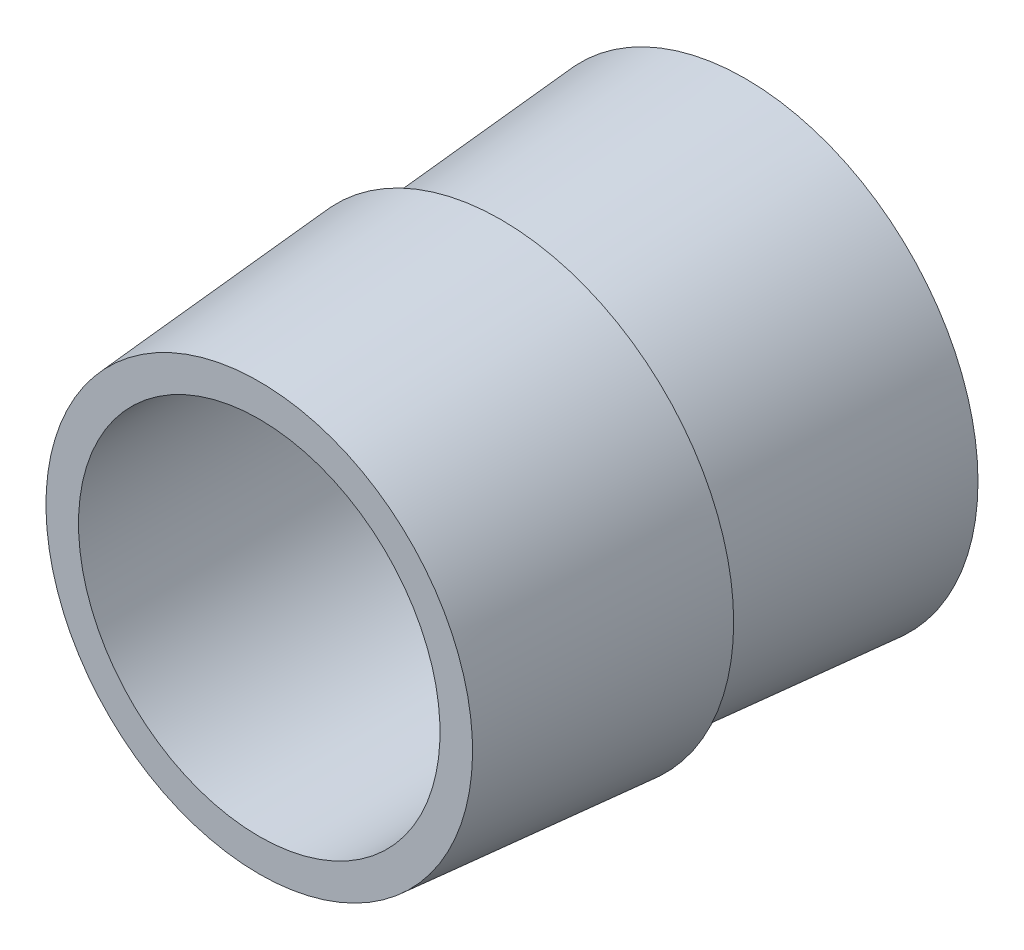
ISO-10303-21;
HEADER;
FILE_DESCRIPTION(('STEP AP214'),'2;1');
FILE_NAME('part.step','',(''),(''),'','','');
FILE_SCHEMA(('AUTOMOTIVE_DESIGN { 1 0 10303 214 1 1 1 1 }'));
ENDSEC;
DATA;
#1=APPLICATION_CONTEXT('core data for automotive mechanical design processes');
#2=APPLICATION_PROTOCOL_DEFINITION('international standard','automotive_design',2000,#1);
#3=PRODUCT_CONTEXT('',#1,'mechanical');
#4=PRODUCT('Part','Part','',(#3));
#5=PRODUCT_RELATED_PRODUCT_CATEGORY('part','',(#4));
#6=PRODUCT_DEFINITION_FORMATION('','',#4);
#7=PRODUCT_DEFINITION_CONTEXT('part definition',#1,'design');
#8=PRODUCT_DEFINITION('design','',#6,#7);
#9=PRODUCT_DEFINITION_SHAPE('','',#8);
#10=(LENGTH_UNIT() NAMED_UNIT(*) SI_UNIT(.MILLI.,.METRE.));
#11=(NAMED_UNIT(*) PLANE_ANGLE_UNIT() SI_UNIT($,.RADIAN.));
#12=(NAMED_UNIT(*) SI_UNIT($,.STERADIAN.) SOLID_ANGLE_UNIT());
#13=UNCERTAINTY_MEASURE_WITH_UNIT(LENGTH_MEASURE(1.E-05),#10,'distance_accuracy_value','');
#14=(GEOMETRIC_REPRESENTATION_CONTEXT(3) GLOBAL_UNCERTAINTY_ASSIGNED_CONTEXT((#13)) GLOBAL_UNIT_ASSIGNED_CONTEXT((#10,
#11,#12)) REPRESENTATION_CONTEXT('',''));
#15=CARTESIAN_POINT('',(0.,0.,0.));
#16=DIRECTION('',(0.,0.,1.));
#17=DIRECTION('',(1.,0.,0.));
#18=AXIS2_PLACEMENT_3D('',#15,#16,#17);
#19=CARTESIAN_POINT('',(0.,-1.26984070723933,-6.85226208595471));
#20=DIRECTION('',(0.,0.,-1.));
#21=DIRECTION('',(0.,1.,0.));
#22=AXIS2_PLACEMENT_3D('',#19,#20,#21);
#23=CONICAL_SURFACE('',#22,3.53968141447866,0.0792126806704468);
#24=CARTESIAN_POINT('',(0.,-1.26984070723933,-3.13807671283925));
#25=DIRECTION('',(0.,0.,1.));
#26=DIRECTION('',(0.,-1.,0.));
#27=AXIS2_PLACEMENT_3D('',#24,#25,#26);
#28=CIRCLE('',#27,3.24485393015888);
#29=CARTESIAN_POINT('',(0.,-4.51469463739821,-3.13807671283925));
#30=VERTEX_POINT('',#29);
#31=EDGE_CURVE('E10',#30,#30,#28,.T.);
#32=ORIENTED_EDGE('',*,*,#31,.F.);
#33=EDGE_LOOP('',(#32));
#34=FACE_BOUND('',#33,.T.);
#35=CARTESIAN_POINT('',(0.,-1.26984070723933,-6.85226208595471));
#36=DIRECTION('',(0.,0.,1.));
#37=DIRECTION('',(0.,-1.,0.));
#38=AXIS2_PLACEMENT_3D('',#35,#36,#37);
#39=CIRCLE('',#38,3.53968141447866);
#40=CARTESIAN_POINT('',(0.,-4.80952212171799,-6.85226208595471));
#41=VERTEX_POINT('',#40);
#42=EDGE_CURVE('E64',#41,#41,#39,.T.);
#43=ORIENTED_EDGE('',*,*,#42,.T.);
#44=EDGE_LOOP('',(#43));
#45=FACE_BOUND('',#44,.T.);
#46=ADVANCED_FACE('F47',(#34,#45),#23,.T.);
#47=CARTESIAN_POINT('',(0.,0.,-3.13807671283925));
#48=DIRECTION('',(0.,0.,1.));
#49=DIRECTION('',(0.,-1.,0.));
#50=AXIS2_PLACEMENT_3D('',#47,#48,#49);
#51=PLANE('',#50);
#52=CARTESIAN_POINT('',(0.,-1.26984070723933,-3.13807671283925));
#53=DIRECTION('',(0.,0.,1.));
#54=DIRECTION('',(0.,-1.,0.));
#55=AXIS2_PLACEMENT_3D('',#52,#53,#54);
#56=CIRCLE('',#55,3.53695393015888);
#57=CARTESIAN_POINT('',(0.,-4.8067946373982,-3.13807671283925));
#58=VERTEX_POINT('',#57);
#59=EDGE_CURVE('E54',#58,#58,#56,.T.);
#60=ORIENTED_EDGE('',*,*,#59,.F.);
#61=EDGE_LOOP('',(#60));
#62=FACE_BOUND('',#61,.T.);
#63=ORIENTED_EDGE('',*,*,#31,.T.);
#64=EDGE_LOOP('',(#63));
#65=FACE_BOUND('',#64,.T.);
#66=ADVANCED_FACE('F95',(#62,#65),#51,.F.);
#67=CARTESIAN_POINT('',(0.,-1.26984070723933,-3.13807671283925));
#68=DIRECTION('',(0.,0.,-1.));
#69=DIRECTION('',(0.,1.,0.));
#70=AXIS2_PLACEMENT_3D('',#67,#68,#69);
#71=CONICAL_SURFACE('',#70,3.53695393015888,0.0792126806704446);
#72=CARTESIAN_POINT('',(0.,-1.26984070723933,0.541748287160756));
#73=DIRECTION('',(0.,0.,1.));
#74=DIRECTION('',(0.,-1.,0.));
#75=AXIS2_PLACEMENT_3D('',#72,#73,#74);
#76=CIRCLE('',#75,3.24485393015888);
#77=CARTESIAN_POINT('',(0.,-4.51469463739821,0.541748287160756));
#78=VERTEX_POINT('',#77);
#79=EDGE_CURVE('E59',#78,#78,#76,.T.);
#80=ORIENTED_EDGE('',*,*,#79,.F.);
#81=EDGE_LOOP('',(#80));
#82=FACE_BOUND('',#81,.T.);
#83=ORIENTED_EDGE('',*,*,#59,.T.);
#84=EDGE_LOOP('',(#83));
#85=FACE_BOUND('',#84,.T.);
#86=ADVANCED_FACE('F100',(#82,#85),#71,.T.);
#87=CARTESIAN_POINT('',(0.,0.,0.541748287160756));
#88=DIRECTION('',(0.,0.,1.));
#89=DIRECTION('',(0.,-1.,0.));
#90=AXIS2_PLACEMENT_3D('',#87,#88,#89);
#91=PLANE('',#90);
#92=CARTESIAN_POINT('',(0.,-1.26984070723933,0.541748287160756));
#93=DIRECTION('',(0.,0.,-1.));
#94=DIRECTION('',(0.,1.,0.));
#95=AXIS2_PLACEMENT_3D('',#92,#93,#94);
#96=CIRCLE('',#95,2.75);
#97=CARTESIAN_POINT('',(0.,1.48015929276067,0.541748287160756));
#98=VERTEX_POINT('',#97);
#99=EDGE_CURVE('E70',#98,#98,#96,.T.);
#100=ORIENTED_EDGE('',*,*,#99,.T.);
#101=EDGE_LOOP('',(#100));
#102=FACE_BOUND('',#101,.T.);
#103=ORIENTED_EDGE('',*,*,#79,.T.);
#104=EDGE_LOOP('',(#103));
#105=FACE_BOUND('',#104,.T.);
#106=ADVANCED_FACE('F79',(#102,#105),#91,.T.);
#107=CARTESIAN_POINT('',(0.,0.,-6.85226208595471));
#108=DIRECTION('',(0.,0.,-1.));
#109=DIRECTION('',(0.,1.,0.));
#110=AXIS2_PLACEMENT_3D('',#107,#108,#109);
#111=PLANE('',#110);
#112=CARTESIAN_POINT('',(0.,-1.26984070723933,-6.85226208595471));
#113=DIRECTION('',(0.,0.,-1.));
#114=DIRECTION('',(0.,1.,0.));
#115=AXIS2_PLACEMENT_3D('',#112,#113,#114);
#116=CIRCLE('',#115,2.75);
#117=CARTESIAN_POINT('',(0.,1.48015929276067,-6.85226208595471));
#118=VERTEX_POINT('',#117);
#119=EDGE_CURVE('E71',#118,#118,#116,.T.);
#120=ORIENTED_EDGE('',*,*,#119,.F.);
#121=EDGE_LOOP('',(#120));
#122=FACE_BOUND('',#121,.T.);
#123=ORIENTED_EDGE('',*,*,#42,.F.);
#124=EDGE_LOOP('',(#123));
#125=FACE_BOUND('',#124,.T.);
#126=ADVANCED_FACE('F85',(#122,#125),#111,.T.);
#127=CARTESIAN_POINT('',(0.,-1.26984070723933,0.541748287160756));
#128=DIRECTION('',(0.,0.,-1.));
#129=DIRECTION('',(0.,1.,0.));
#130=AXIS2_PLACEMENT_3D('',#127,#128,#129);
#131=CYLINDRICAL_SURFACE('',#130,2.75);
#132=ORIENTED_EDGE('',*,*,#99,.F.);
#133=EDGE_LOOP('',(#132));
#134=FACE_BOUND('',#133,.T.);
#135=ORIENTED_EDGE('',*,*,#119,.T.);
#136=EDGE_LOOP('',(#135));
#137=FACE_BOUND('',#136,.T.);
#138=ADVANCED_FACE('F82',(#134,#137),#131,.F.);
#139=CLOSED_SHELL('',(#46,#66,#86,#106,#126,#138));
#140=MANIFOLD_SOLID_BREP('B2',#139);
#141=ADVANCED_BREP_SHAPE_REPRESENTATION('',(#18,#140),#14);
#142=SHAPE_DEFINITION_REPRESENTATION(#9,#141);
ENDSEC;
END-ISO-10303-21;
